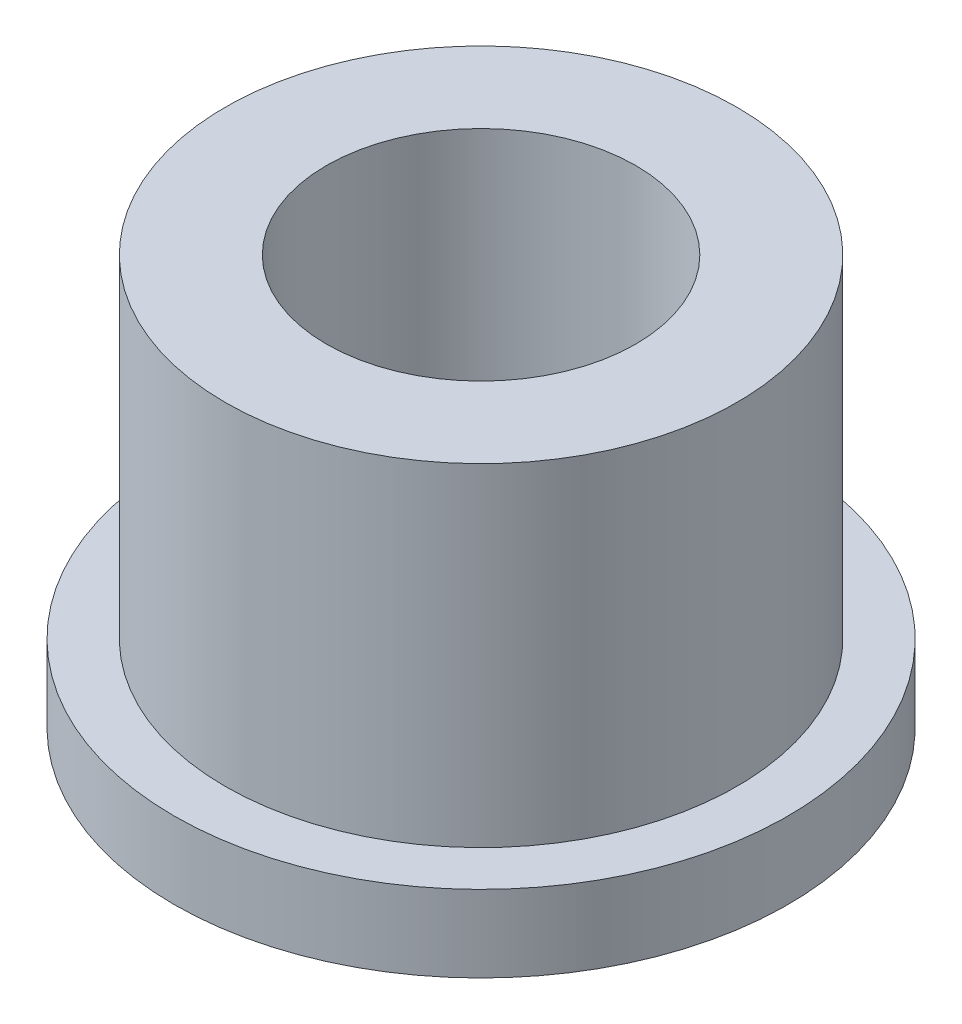
ISO-10303-21;
HEADER;
FILE_DESCRIPTION(('STEP AP214'),'2;1');
FILE_NAME('part.step','',(''),(''),'','','');
FILE_SCHEMA(('AUTOMOTIVE_DESIGN { 1 0 10303 214 1 1 1 1 }'));
ENDSEC;
DATA;
#1=APPLICATION_CONTEXT('core data for automotive mechanical design processes');
#2=APPLICATION_PROTOCOL_DEFINITION('international standard','automotive_design',2000,#1);
#3=PRODUCT_CONTEXT('',#1,'mechanical');
#4=PRODUCT('Part','Part','',(#3));
#5=PRODUCT_RELATED_PRODUCT_CATEGORY('part','',(#4));
#6=PRODUCT_DEFINITION_FORMATION('','',#4);
#7=PRODUCT_DEFINITION_CONTEXT('part definition',#1,'design');
#8=PRODUCT_DEFINITION('design','',#6,#7);
#9=PRODUCT_DEFINITION_SHAPE('','',#8);
#10=(LENGTH_UNIT() NAMED_UNIT(*) SI_UNIT(.MILLI.,.METRE.));
#11=(NAMED_UNIT(*) PLANE_ANGLE_UNIT() SI_UNIT($,.RADIAN.));
#12=(NAMED_UNIT(*) SI_UNIT($,.STERADIAN.) SOLID_ANGLE_UNIT());
#13=UNCERTAINTY_MEASURE_WITH_UNIT(LENGTH_MEASURE(1.E-05),#10,'distance_accuracy_value','');
#14=(GEOMETRIC_REPRESENTATION_CONTEXT(3) GLOBAL_UNCERTAINTY_ASSIGNED_CONTEXT((#13)) GLOBAL_UNIT_ASSIGNED_CONTEXT((#10,
#11,#12)) REPRESENTATION_CONTEXT('',''));
#15=CARTESIAN_POINT('',(0.,0.,0.));
#16=DIRECTION('',(0.,0.,1.));
#17=DIRECTION('',(1.,0.,0.));
#18=AXIS2_PLACEMENT_3D('',#15,#16,#17);
#19=CARTESIAN_POINT('',(0.,6.35,0.));
#20=DIRECTION('',(0.,1.,0.));
#21=DIRECTION('',(0.,0.,1.));
#22=AXIS2_PLACEMENT_3D('',#19,#20,#21);
#23=PLANE('',#22);
#24=CARTESIAN_POINT('',(0.,6.35,0.));
#25=DIRECTION('',(0.,1.,0.));
#26=DIRECTION('',(0.,0.,1.));
#27=AXIS2_PLACEMENT_3D('',#24,#25,#26);
#28=CIRCLE('',#27,3.96875);
#29=CARTESIAN_POINT('',(0.,6.35,3.96875));
#30=VERTEX_POINT('',#29);
#31=EDGE_CURVE('E10',#30,#30,#28,.T.);
#32=ORIENTED_EDGE('',*,*,#31,.T.);
#33=EDGE_LOOP('',(#32));
#34=FACE_BOUND('',#33,.T.);
#35=CARTESIAN_POINT('',(0.,6.35,0.));
#36=DIRECTION('',(0.,1.,0.));
#37=DIRECTION('',(0.,0.,1.));
#38=AXIS2_PLACEMENT_3D('',#35,#36,#37);
#39=CIRCLE('',#38,2.4003);
#40=CARTESIAN_POINT('',(0.,6.35,2.4003));
#41=VERTEX_POINT('',#40);
#42=EDGE_CURVE('E42',#41,#41,#39,.T.);
#43=ORIENTED_EDGE('',*,*,#42,.F.);
#44=EDGE_LOOP('',(#43));
#45=FACE_BOUND('',#44,.T.);
#46=ADVANCED_FACE('F35',(#34,#45),#23,.T.);
#47=CARTESIAN_POINT('',(0.,0.,0.));
#48=DIRECTION('',(0.,1.,0.));
#49=DIRECTION('',(0.,0.,1.));
#50=AXIS2_PLACEMENT_3D('',#47,#48,#49);
#51=PLANE('',#50);
#52=CARTESIAN_POINT('',(0.,0.,0.));
#53=DIRECTION('',(0.,1.,0.));
#54=DIRECTION('',(0.,0.,1.));
#55=AXIS2_PLACEMENT_3D('',#52,#53,#54);
#56=CIRCLE('',#55,2.4003);
#57=CARTESIAN_POINT('',(0.,0.,2.4003));
#58=VERTEX_POINT('',#57);
#59=EDGE_CURVE('E46',#58,#58,#56,.T.);
#60=ORIENTED_EDGE('',*,*,#59,.T.);
#61=EDGE_LOOP('',(#60));
#62=FACE_BOUND('',#61,.T.);
#63=CARTESIAN_POINT('',(0.,0.,0.));
#64=DIRECTION('',(0.,1.,0.));
#65=DIRECTION('',(0.,0.,1.));
#66=AXIS2_PLACEMENT_3D('',#63,#64,#65);
#67=CIRCLE('',#66,4.7625);
#68=CARTESIAN_POINT('',(0.,0.,4.7625));
#69=VERTEX_POINT('',#68);
#70=EDGE_CURVE('E53',#69,#69,#67,.T.);
#71=ORIENTED_EDGE('',*,*,#70,.F.);
#72=EDGE_LOOP('',(#71));
#73=FACE_BOUND('',#72,.T.);
#74=ADVANCED_FACE('F78',(#62,#73),#51,.F.);
#75=CARTESIAN_POINT('',(0.,6.35,0.));
#76=DIRECTION('',(0.,-1.,0.));
#77=DIRECTION('',(0.,0.,-1.));
#78=AXIS2_PLACEMENT_3D('',#75,#76,#77);
#79=CYLINDRICAL_SURFACE('',#78,3.96875);
#80=CARTESIAN_POINT('',(0.,1.190625,0.));
#81=DIRECTION('',(0.,1.,0.));
#82=DIRECTION('',(0.,0.,1.));
#83=AXIS2_PLACEMENT_3D('',#80,#81,#82);
#84=CIRCLE('',#83,3.96875);
#85=CARTESIAN_POINT('',(0.,1.190625,3.96875));
#86=VERTEX_POINT('',#85);
#87=EDGE_CURVE('E56',#86,#86,#84,.T.);
#88=ORIENTED_EDGE('',*,*,#87,.T.);
#89=EDGE_LOOP('',(#88));
#90=FACE_BOUND('',#89,.T.);
#91=ORIENTED_EDGE('',*,*,#31,.F.);
#92=EDGE_LOOP('',(#91));
#93=FACE_BOUND('',#92,.T.);
#94=ADVANCED_FACE('F37',(#90,#93),#79,.T.);
#95=CARTESIAN_POINT('',(0.,6.35,0.));
#96=DIRECTION('',(0.,-1.,0.));
#97=DIRECTION('',(0.,0.,-1.));
#98=AXIS2_PLACEMENT_3D('',#95,#96,#97);
#99=CYLINDRICAL_SURFACE('',#98,2.4003);
#100=ORIENTED_EDGE('',*,*,#42,.T.);
#101=EDGE_LOOP('',(#100));
#102=FACE_BOUND('',#101,.T.);
#103=ORIENTED_EDGE('',*,*,#59,.F.);
#104=EDGE_LOOP('',(#103));
#105=FACE_BOUND('',#104,.T.);
#106=ADVANCED_FACE('F67',(#102,#105),#99,.F.);
#107=CARTESIAN_POINT('',(0.,1.190625,0.));
#108=DIRECTION('',(0.,1.,0.));
#109=DIRECTION('',(0.,0.,1.));
#110=AXIS2_PLACEMENT_3D('',#107,#108,#109);
#111=PLANE('',#110);
#112=CARTESIAN_POINT('',(0.,1.190625,0.));
#113=DIRECTION('',(0.,1.,0.));
#114=DIRECTION('',(0.,0.,1.));
#115=AXIS2_PLACEMENT_3D('',#112,#113,#114);
#116=CIRCLE('',#115,4.7625);
#117=CARTESIAN_POINT('',(0.,1.190625,4.7625));
#118=VERTEX_POINT('',#117);
#119=EDGE_CURVE('E51',#118,#118,#116,.T.);
#120=ORIENTED_EDGE('',*,*,#119,.T.);
#121=EDGE_LOOP('',(#120));
#122=FACE_BOUND('',#121,.T.);
#123=ORIENTED_EDGE('',*,*,#87,.F.);
#124=EDGE_LOOP('',(#123));
#125=FACE_BOUND('',#124,.T.);
#126=ADVANCED_FACE('F64',(#122,#125),#111,.T.);
#127=CARTESIAN_POINT('',(0.,1.190625,0.));
#128=DIRECTION('',(0.,-1.,0.));
#129=DIRECTION('',(0.,0.,-1.));
#130=AXIS2_PLACEMENT_3D('',#127,#128,#129);
#131=CYLINDRICAL_SURFACE('',#130,4.7625);
#132=ORIENTED_EDGE('',*,*,#119,.F.);
#133=EDGE_LOOP('',(#132));
#134=FACE_BOUND('',#133,.T.);
#135=ORIENTED_EDGE('',*,*,#70,.T.);
#136=EDGE_LOOP('',(#135));
#137=FACE_BOUND('',#136,.T.);
#138=ADVANCED_FACE('F66',(#134,#137),#131,.T.);
#139=CLOSED_SHELL('',(#46,#74,#94,#106,#126,#138));
#140=MANIFOLD_SOLID_BREP('B2',#139);
#141=ADVANCED_BREP_SHAPE_REPRESENTATION('',(#18,#140),#14);
#142=SHAPE_DEFINITION_REPRESENTATION(#9,#141);
ENDSEC;
END-ISO-10303-21;
